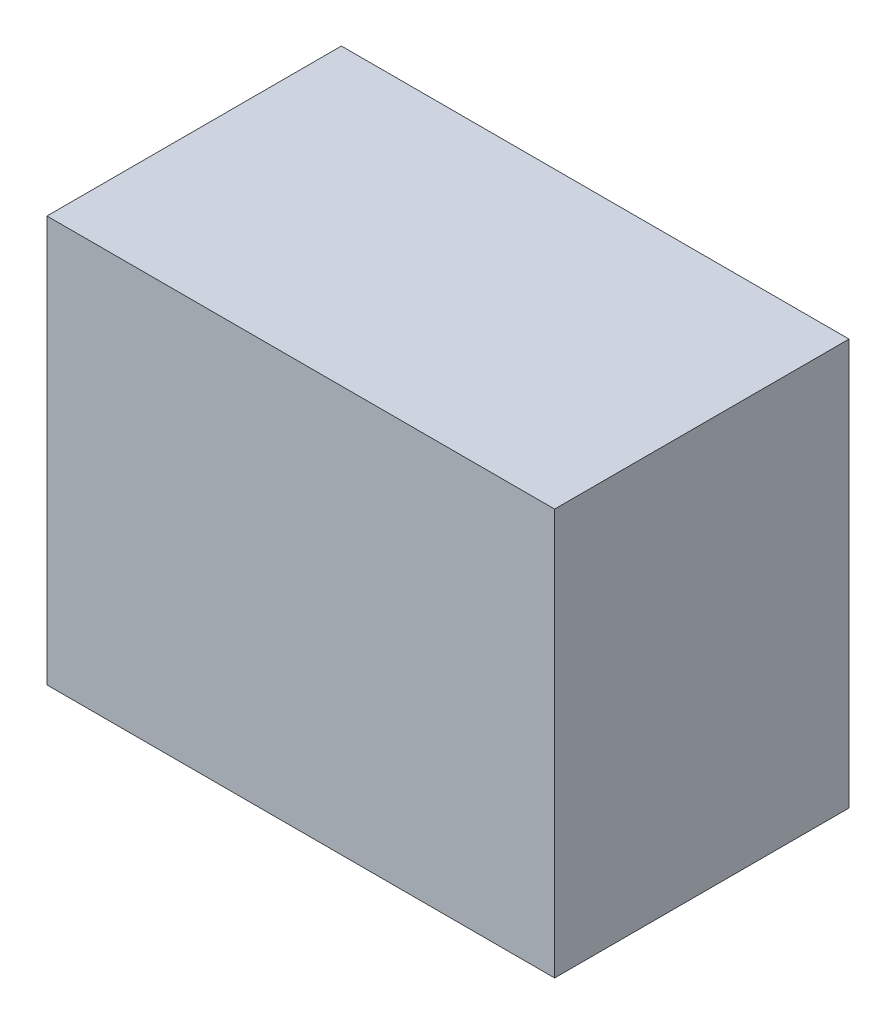
ISO-10303-21;
HEADER;
FILE_DESCRIPTION(('STEP AP214'),'2;1');
FILE_NAME('part.step','',(''),(''),'','','');
FILE_SCHEMA(('AUTOMOTIVE_DESIGN { 1 0 10303 214 1 1 1 1 }'));
ENDSEC;
DATA;
#1=APPLICATION_CONTEXT('core data for automotive mechanical design processes');
#2=APPLICATION_PROTOCOL_DEFINITION('international standard','automotive_design',2000,#1);
#3=PRODUCT_CONTEXT('',#1,'mechanical');
#4=PRODUCT('Part','Part','',(#3));
#5=PRODUCT_RELATED_PRODUCT_CATEGORY('part','',(#4));
#6=PRODUCT_DEFINITION_FORMATION('','',#4);
#7=PRODUCT_DEFINITION_CONTEXT('part definition',#1,'design');
#8=PRODUCT_DEFINITION('design','',#6,#7);
#9=PRODUCT_DEFINITION_SHAPE('','',#8);
#10=(LENGTH_UNIT() NAMED_UNIT(*) SI_UNIT(.MILLI.,.METRE.));
#11=(NAMED_UNIT(*) PLANE_ANGLE_UNIT() SI_UNIT($,.RADIAN.));
#12=(NAMED_UNIT(*) SI_UNIT($,.STERADIAN.) SOLID_ANGLE_UNIT());
#13=UNCERTAINTY_MEASURE_WITH_UNIT(LENGTH_MEASURE(1.E-05),#10,'distance_accuracy_value','');
#14=(GEOMETRIC_REPRESENTATION_CONTEXT(3) GLOBAL_UNCERTAINTY_ASSIGNED_CONTEXT((#13)) GLOBAL_UNIT_ASSIGNED_CONTEXT((#10,
#11,#12)) REPRESENTATION_CONTEXT('',''));
#15=CARTESIAN_POINT('',(0.,0.,0.));
#16=DIRECTION('',(0.,0.,1.));
#17=DIRECTION('',(1.,0.,0.));
#18=AXIS2_PLACEMENT_3D('',#15,#16,#17);
#19=CARTESIAN_POINT('',(0.499999,-0.3999992,0.58000138));
#20=DIRECTION('',(0.,0.,-1.));
#21=DIRECTION('',(-1.,0.,0.));
#22=AXIS2_PLACEMENT_3D('',#19,#20,#21);
#23=PLANE('',#22);
#24=DIRECTION('',(1.,0.,0.));
#25=VECTOR('',#24,1.);
#26=CARTESIAN_POINT('',(0.499999,0.3999992,0.58000138));
#27=LINE('',#26,#25);
#28=CARTESIAN_POINT('',(0.499999,0.3999992,0.58000138));
#29=VERTEX_POINT('',#28);
#30=CARTESIAN_POINT('',(-0.499999,0.3999992,0.58000138));
#31=VERTEX_POINT('',#30);
#32=EDGE_CURVE('E55',#29,#31,#27,.F.);
#33=ORIENTED_EDGE('',*,*,#32,.T.);
#34=DIRECTION('',(0.,1.,0.));
#35=VECTOR('',#34,1.);
#36=CARTESIAN_POINT('',(-0.499999,0.3999992,0.58000138));
#37=LINE('',#36,#35);
#38=CARTESIAN_POINT('',(-0.499999,-0.3999992,0.58000138));
#39=VERTEX_POINT('',#38);
#40=EDGE_CURVE('E57',#31,#39,#37,.F.);
#41=ORIENTED_EDGE('',*,*,#40,.T.);
#42=DIRECTION('',(1.,0.,0.));
#43=VECTOR('',#42,1.);
#44=CARTESIAN_POINT('',(-0.499999,-0.3999992,0.58000138));
#45=LINE('',#44,#43);
#46=CARTESIAN_POINT('',(0.499999,-0.3999992,0.58000138));
#47=VERTEX_POINT('',#46);
#48=EDGE_CURVE('E20',#39,#47,#45,.T.);
#49=ORIENTED_EDGE('',*,*,#48,.T.);
#50=DIRECTION('',(0.,1.,0.));
#51=VECTOR('',#50,1.);
#52=CARTESIAN_POINT('',(0.499999,-0.3999992,0.58000138));
#53=LINE('',#52,#51);
#54=EDGE_CURVE('E80',#47,#29,#53,.T.);
#55=ORIENTED_EDGE('',*,*,#54,.T.);
#56=EDGE_LOOP('',(#33,#41,#49,#55));
#57=FACE_BOUND('',#56,.T.);
#58=ADVANCED_FACE('F17',(#57),#23,.F.);
#59=CARTESIAN_POINT('',(-0.499999,-0.3999992,0.));
#60=DIRECTION('',(0.,1.,0.));
#61=DIRECTION('',(0.,0.,1.));
#62=AXIS2_PLACEMENT_3D('',#59,#60,#61);
#63=PLANE('',#62);
#64=DIRECTION('',(0.,0.,1.));
#65=VECTOR('',#64,1.);
#66=CARTESIAN_POINT('',(0.499999,-0.3999992,0.));
#67=LINE('',#66,#65);
#68=CARTESIAN_POINT('',(0.499999,-0.3999992,0.));
#69=VERTEX_POINT('',#68);
#70=EDGE_CURVE('E68',#69,#47,#67,.T.);
#71=ORIENTED_EDGE('',*,*,#70,.T.);
#72=ORIENTED_EDGE('',*,*,#48,.F.);
#73=DIRECTION('',(0.,0.,-1.));
#74=VECTOR('',#73,1.);
#75=CARTESIAN_POINT('',(-0.499999,-0.3999992,0.));
#76=LINE('',#75,#74);
#77=CARTESIAN_POINT('',(-0.499999,-0.3999992,0.));
#78=VERTEX_POINT('',#77);
#79=EDGE_CURVE('E63',#39,#78,#76,.T.);
#80=ORIENTED_EDGE('',*,*,#79,.T.);
#81=DIRECTION('',(-1.,0.,0.));
#82=VECTOR('',#81,1.);
#83=CARTESIAN_POINT('',(0.499999,-0.3999992,0.));
#84=LINE('',#83,#82);
#85=EDGE_CURVE('E83',#69,#78,#84,.T.);
#86=ORIENTED_EDGE('',*,*,#85,.F.);
#87=EDGE_LOOP('',(#71,#72,#80,#86));
#88=FACE_BOUND('',#87,.T.);
#89=ADVANCED_FACE('F65',(#88),#63,.F.);
#90=CARTESIAN_POINT('',(-0.499999,0.3999992,0.));
#91=DIRECTION('',(1.,0.,0.));
#92=DIRECTION('',(0.,0.,-1.));
#93=AXIS2_PLACEMENT_3D('',#90,#91,#92);
#94=PLANE('',#93);
#95=ORIENTED_EDGE('',*,*,#79,.F.);
#96=ORIENTED_EDGE('',*,*,#40,.F.);
#97=DIRECTION('',(0.,0.,-1.));
#98=VECTOR('',#97,1.);
#99=CARTESIAN_POINT('',(-0.499999,0.3999992,0.));
#100=LINE('',#99,#98);
#101=CARTESIAN_POINT('',(-0.499999,0.3999992,0.));
#102=VERTEX_POINT('',#101);
#103=EDGE_CURVE('E75',#31,#102,#100,.T.);
#104=ORIENTED_EDGE('',*,*,#103,.T.);
#105=DIRECTION('',(0.,1.,0.));
#106=VECTOR('',#105,1.);
#107=CARTESIAN_POINT('',(-0.499999,-0.3999992,0.));
#108=LINE('',#107,#106);
#109=EDGE_CURVE('E72',#78,#102,#108,.T.);
#110=ORIENTED_EDGE('',*,*,#109,.F.);
#111=EDGE_LOOP('',(#95,#96,#104,#110));
#112=FACE_BOUND('',#111,.T.);
#113=ADVANCED_FACE('F70',(#112),#94,.F.);
#114=CARTESIAN_POINT('',(0.499999,0.3999992,0.));
#115=DIRECTION('',(0.,-1.,0.));
#116=DIRECTION('',(0.,0.,-1.));
#117=AXIS2_PLACEMENT_3D('',#114,#115,#116);
#118=PLANE('',#117);
#119=ORIENTED_EDGE('',*,*,#103,.F.);
#120=ORIENTED_EDGE('',*,*,#32,.F.);
#121=DIRECTION('',(0.,0.,1.));
#122=VECTOR('',#121,1.);
#123=CARTESIAN_POINT('',(0.499999,0.3999992,0.));
#124=LINE('',#123,#122);
#125=CARTESIAN_POINT('',(0.499999,0.3999992,0.));
#126=VERTEX_POINT('',#125);
#127=EDGE_CURVE('E35',#29,#126,#124,.F.);
#128=ORIENTED_EDGE('',*,*,#127,.T.);
#129=DIRECTION('',(-1.,0.,0.));
#130=VECTOR('',#129,1.);
#131=CARTESIAN_POINT('',(0.499999,0.3999992,0.));
#132=LINE('',#131,#130);
#133=EDGE_CURVE('E26',#102,#126,#132,.F.);
#134=ORIENTED_EDGE('',*,*,#133,.F.);
#135=EDGE_LOOP('',(#119,#120,#128,#134));
#136=FACE_BOUND('',#135,.T.);
#137=ADVANCED_FACE('F89',(#136),#118,.F.);
#138=CARTESIAN_POINT('',(0.499999,-0.3999992,0.));
#139=DIRECTION('',(-1.,0.,0.));
#140=DIRECTION('',(0.,0.,1.));
#141=AXIS2_PLACEMENT_3D('',#138,#139,#140);
#142=PLANE('',#141);
#143=ORIENTED_EDGE('',*,*,#127,.F.);
#144=ORIENTED_EDGE('',*,*,#54,.F.);
#145=ORIENTED_EDGE('',*,*,#70,.F.);
#146=DIRECTION('',(0.,1.,0.));
#147=VECTOR('',#146,1.);
#148=CARTESIAN_POINT('',(0.499999,-0.3999992,0.));
#149=LINE('',#148,#147);
#150=EDGE_CURVE('E11',#126,#69,#149,.F.);
#151=ORIENTED_EDGE('',*,*,#150,.F.);
#152=EDGE_LOOP('',(#143,#144,#145,#151));
#153=FACE_BOUND('',#152,.T.);
#154=ADVANCED_FACE('F91',(#153),#142,.F.);
#155=CARTESIAN_POINT('',(0.499999,-0.3999992,0.));
#156=DIRECTION('',(0.,0.,-1.));
#157=DIRECTION('',(-1.,0.,0.));
#158=AXIS2_PLACEMENT_3D('',#155,#156,#157);
#159=PLANE('',#158);
#160=ORIENTED_EDGE('',*,*,#133,.T.);
#161=ORIENTED_EDGE('',*,*,#150,.T.);
#162=ORIENTED_EDGE('',*,*,#85,.T.);
#163=ORIENTED_EDGE('',*,*,#109,.T.);
#164=EDGE_LOOP('',(#160,#161,#162,#163));
#165=FACE_BOUND('',#164,.T.);
#166=ADVANCED_FACE('F88',(#165),#159,.T.);
#167=CLOSED_SHELL('',(#58,#89,#113,#137,#154,#166));
#168=MANIFOLD_SOLID_BREP('B1',#167);
#169=ADVANCED_BREP_SHAPE_REPRESENTATION('',(#18,#168),#14);
#170=SHAPE_DEFINITION_REPRESENTATION(#9,#169);
ENDSEC;
END-ISO-10303-21;
